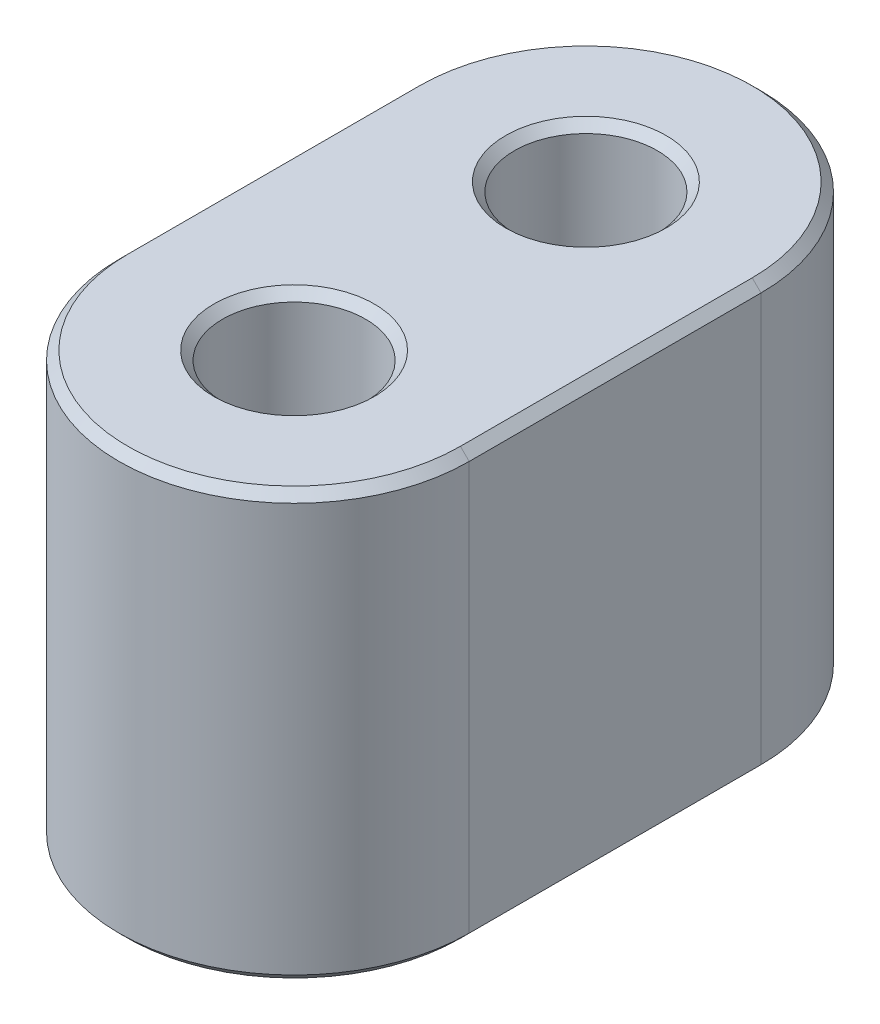
ISO-10303-21;
HEADER;
FILE_DESCRIPTION(('STEP AP214'),'2;1');
FILE_NAME('part.step','',(''),(''),'','','');
FILE_SCHEMA(('AUTOMOTIVE_DESIGN { 1 0 10303 214 1 1 1 1 }'));
ENDSEC;
DATA;
#1=APPLICATION_CONTEXT('core data for automotive mechanical design processes');
#2=APPLICATION_PROTOCOL_DEFINITION('international standard','automotive_design',2000,#1);
#3=PRODUCT_CONTEXT('',#1,'mechanical');
#4=PRODUCT('Part','Part','',(#3));
#5=PRODUCT_RELATED_PRODUCT_CATEGORY('part','',(#4));
#6=PRODUCT_DEFINITION_FORMATION('','',#4);
#7=PRODUCT_DEFINITION_CONTEXT('part definition',#1,'design');
#8=PRODUCT_DEFINITION('design','',#6,#7);
#9=PRODUCT_DEFINITION_SHAPE('','',#8);
#10=(LENGTH_UNIT() NAMED_UNIT(*) SI_UNIT(.MILLI.,.METRE.));
#11=(NAMED_UNIT(*) PLANE_ANGLE_UNIT() SI_UNIT($,.RADIAN.));
#12=(NAMED_UNIT(*) SI_UNIT($,.STERADIAN.) SOLID_ANGLE_UNIT());
#13=UNCERTAINTY_MEASURE_WITH_UNIT(LENGTH_MEASURE(1.E-05),#10,'distance_accuracy_value','');
#14=(GEOMETRIC_REPRESENTATION_CONTEXT(3) GLOBAL_UNCERTAINTY_ASSIGNED_CONTEXT((#13)) GLOBAL_UNIT_ASSIGNED_CONTEXT((#10,
#11,#12)) REPRESENTATION_CONTEXT('',''));
#15=CARTESIAN_POINT('',(0.,0.,0.));
#16=DIRECTION('',(0.,0.,1.));
#17=DIRECTION('',(1.,0.,0.));
#18=AXIS2_PLACEMENT_3D('',#15,#16,#17);
#19=CARTESIAN_POINT('',(0.,14.6,0.));
#20=DIRECTION('',(0.,1.,0.));
#21=DIRECTION('',(0.,0.,1.));
#22=AXIS2_PLACEMENT_3D('',#19,#20,#21);
#23=PLANE('',#22);
#24=CARTESIAN_POINT('',(0.,14.6,-10.));
#25=DIRECTION('',(0.,1.,0.));
#26=DIRECTION('',(0.,0.,1.));
#27=AXIS2_PLACEMENT_3D('',#24,#25,#26);
#28=CIRCLE('',#27,2.75);
#29=CARTESIAN_POINT('',(0.,14.6,-7.25));
#30=VERTEX_POINT('',#29);
#31=EDGE_CURVE('E140',#30,#30,#28,.F.);
#32=ORIENTED_EDGE('',*,*,#31,.T.);
#33=EDGE_LOOP('',(#32));
#34=FACE_BOUND('',#33,.T.);
#35=CARTESIAN_POINT('',(0.,14.6,-10.));
#36=DIRECTION('',(0.,1.,0.));
#37=DIRECTION('',(0.,0.,1.));
#38=AXIS2_PLACEMENT_3D('',#35,#36,#37);
#39=CIRCLE('',#38,5.7);
#40=CARTESIAN_POINT('',(5.7,14.6,-10.));
#41=VERTEX_POINT('',#40);
#42=CARTESIAN_POINT('',(-5.7,14.6,-10.));
#43=VERTEX_POINT('',#42);
#44=EDGE_CURVE('E137',#41,#43,#39,.T.);
#45=ORIENTED_EDGE('',*,*,#44,.T.);
#46=DIRECTION('',(0.,0.,1.));
#47=VECTOR('',#46,1.);
#48=CARTESIAN_POINT('',(-5.7,14.6,0.));
#49=LINE('',#48,#47);
#50=CARTESIAN_POINT('',(-5.7,14.6,0.));
#51=VERTEX_POINT('',#50);
#52=EDGE_CURVE('E117',#43,#51,#49,.T.);
#53=ORIENTED_EDGE('',*,*,#52,.T.);
#54=CARTESIAN_POINT('',(0.,14.6,0.));
#55=DIRECTION('',(0.,1.,0.));
#56=DIRECTION('',(0.,0.,1.));
#57=AXIS2_PLACEMENT_3D('',#54,#55,#56);
#58=CIRCLE('',#57,5.7);
#59=CARTESIAN_POINT('',(5.7,14.6,0.));
#60=VERTEX_POINT('',#59);
#61=EDGE_CURVE('E125',#51,#60,#58,.T.);
#62=ORIENTED_EDGE('',*,*,#61,.T.);
#63=DIRECTION('',(0.,0.,-1.));
#64=VECTOR('',#63,1.);
#65=CARTESIAN_POINT('',(5.7,14.6,-10.));
#66=LINE('',#65,#64);
#67=EDGE_CURVE('E132',#60,#41,#66,.T.);
#68=ORIENTED_EDGE('',*,*,#67,.T.);
#69=EDGE_LOOP('',(#45,#53,#62,#68));
#70=FACE_BOUND('',#69,.T.);
#71=CARTESIAN_POINT('',(0.,14.6,0.));
#72=DIRECTION('',(0.,1.,0.));
#73=DIRECTION('',(0.,0.,1.));
#74=AXIS2_PLACEMENT_3D('',#71,#72,#73);
#75=CIRCLE('',#74,2.75);
#76=CARTESIAN_POINT('',(0.,14.6,2.75));
#77=VERTEX_POINT('',#76);
#78=EDGE_CURVE('E133',#77,#77,#75,.F.);
#79=ORIENTED_EDGE('',*,*,#78,.T.);
#80=EDGE_LOOP('',(#79));
#81=FACE_BOUND('',#80,.T.);
#82=ADVANCED_FACE('F43',(#34,#70,#81),#23,.T.);
#83=CARTESIAN_POINT('',(0.,0.,0.));
#84=DIRECTION('',(0.,1.,0.));
#85=DIRECTION('',(0.,0.,1.));
#86=AXIS2_PLACEMENT_3D('',#83,#84,#85);
#87=PLANE('',#86);
#88=CARTESIAN_POINT('',(0.,0.,-10.));
#89=DIRECTION('',(0.,1.,0.));
#90=DIRECTION('',(0.,0.,1.));
#91=AXIS2_PLACEMENT_3D('',#88,#89,#90);
#92=CIRCLE('',#91,2.75);
#93=CARTESIAN_POINT('',(0.,0.,-7.25));
#94=VERTEX_POINT('',#93);
#95=EDGE_CURVE('E11',#94,#94,#92,.T.);
#96=ORIENTED_EDGE('',*,*,#95,.T.);
#97=EDGE_LOOP('',(#96));
#98=FACE_BOUND('',#97,.T.);
#99=CARTESIAN_POINT('',(0.,0.,0.));
#100=DIRECTION('',(0.,1.,0.));
#101=DIRECTION('',(0.,0.,1.));
#102=AXIS2_PLACEMENT_3D('',#99,#100,#101);
#103=CIRCLE('',#102,2.75);
#104=CARTESIAN_POINT('',(0.,0.,2.75));
#105=VERTEX_POINT('',#104);
#106=EDGE_CURVE('E54',#105,#105,#103,.T.);
#107=ORIENTED_EDGE('',*,*,#106,.T.);
#108=EDGE_LOOP('',(#107));
#109=FACE_BOUND('',#108,.T.);
#110=CARTESIAN_POINT('',(0.,0.,-10.));
#111=DIRECTION('',(0.,1.,0.));
#112=DIRECTION('',(0.,0.,1.));
#113=AXIS2_PLACEMENT_3D('',#110,#111,#112);
#114=CIRCLE('',#113,5.69999999999999);
#115=CARTESIAN_POINT('',(-5.69999999999999,0.,-10.));
#116=VERTEX_POINT('',#115);
#117=CARTESIAN_POINT('',(5.69999999999999,0.,-10.));
#118=VERTEX_POINT('',#117);
#119=EDGE_CURVE('E62',#116,#118,#114,.F.);
#120=ORIENTED_EDGE('',*,*,#119,.T.);
#121=DIRECTION('',(0.,0.,1.));
#122=VECTOR('',#121,1.);
#123=CARTESIAN_POINT('',(5.69999999999999,0.,0.));
#124=LINE('',#123,#122);
#125=CARTESIAN_POINT('',(5.69999999999999,0.,0.));
#126=VERTEX_POINT('',#125);
#127=EDGE_CURVE('E189',#118,#126,#124,.T.);
#128=ORIENTED_EDGE('',*,*,#127,.T.);
#129=CARTESIAN_POINT('',(0.,0.,0.));
#130=DIRECTION('',(0.,1.,0.));
#131=DIRECTION('',(0.,0.,1.));
#132=AXIS2_PLACEMENT_3D('',#129,#130,#131);
#133=CIRCLE('',#132,5.69999999999999);
#134=CARTESIAN_POINT('',(-5.69999999999999,0.,0.));
#135=VERTEX_POINT('',#134);
#136=EDGE_CURVE('E182',#126,#135,#133,.F.);
#137=ORIENTED_EDGE('',*,*,#136,.T.);
#138=DIRECTION('',(0.,0.,-1.));
#139=VECTOR('',#138,1.);
#140=CARTESIAN_POINT('',(-5.69999999999999,0.,0.));
#141=LINE('',#140,#139);
#142=EDGE_CURVE('E67',#135,#116,#141,.T.);
#143=ORIENTED_EDGE('',*,*,#142,.T.);
#144=EDGE_LOOP('',(#120,#128,#137,#143));
#145=FACE_BOUND('',#144,.T.);
#146=ADVANCED_FACE('F222',(#98,#109,#145),#87,.F.);
#147=CARTESIAN_POINT('',(0.,14.6,0.));
#148=DIRECTION('',(0.,-1.,0.));
#149=DIRECTION('',(0.,0.,-1.));
#150=AXIS2_PLACEMENT_3D('',#147,#148,#149);
#151=CYLINDRICAL_SURFACE('',#150,6.);
#152=DIRECTION('',(0.,-1.,0.));
#153=VECTOR('',#152,1.);
#154=CARTESIAN_POINT('',(6.,14.6,0.));
#155=LINE('',#154,#153);
#156=CARTESIAN_POINT('',(6.,14.3,0.));
#157=VERTEX_POINT('',#156);
#158=CARTESIAN_POINT('',(6.,0.300000000000007,0.));
#159=VERTEX_POINT('',#158);
#160=EDGE_CURVE('E462',#157,#159,#155,.T.);
#161=ORIENTED_EDGE('',*,*,#160,.F.);
#162=CARTESIAN_POINT('',(0.,14.3,0.));
#163=DIRECTION('',(0.,1.,0.));
#164=DIRECTION('',(0.,0.,1.));
#165=AXIS2_PLACEMENT_3D('',#162,#163,#164);
#166=CIRCLE('',#165,6.);
#167=CARTESIAN_POINT('',(-6.,14.3,0.));
#168=VERTEX_POINT('',#167);
#169=EDGE_CURVE('E171',#157,#168,#166,.F.);
#170=ORIENTED_EDGE('',*,*,#169,.T.);
#171=DIRECTION('',(0.,-1.,0.));
#172=VECTOR('',#171,1.);
#173=CARTESIAN_POINT('',(-6.,14.6,0.));
#174=LINE('',#173,#172);
#175=CARTESIAN_POINT('',(-6.,0.300000000000007,0.));
#176=VERTEX_POINT('',#175);
#177=EDGE_CURVE('E200',#168,#176,#174,.T.);
#178=ORIENTED_EDGE('',*,*,#177,.T.);
#179=CARTESIAN_POINT('',(0.,0.300000000000007,0.));
#180=DIRECTION('',(0.,1.,0.));
#181=DIRECTION('',(0.,0.,1.));
#182=AXIS2_PLACEMENT_3D('',#179,#180,#181);
#183=CIRCLE('',#182,6.);
#184=EDGE_CURVE('E168',#176,#159,#183,.T.);
#185=ORIENTED_EDGE('',*,*,#184,.T.);
#186=EDGE_LOOP('',(#161,#170,#178,#185));
#187=FACE_BOUND('',#186,.T.);
#188=ADVANCED_FACE('F224',(#187),#151,.T.);
#189=CARTESIAN_POINT('',(6.,14.6,0.));
#190=DIRECTION('',(-1.,0.,0.));
#191=DIRECTION('',(0.,0.,1.));
#192=AXIS2_PLACEMENT_3D('',#189,#190,#191);
#193=PLANE('',#192);
#194=DIRECTION('',(0.,-1.,0.));
#195=VECTOR('',#194,1.);
#196=CARTESIAN_POINT('',(6.,14.6,-10.));
#197=LINE('',#196,#195);
#198=CARTESIAN_POINT('',(6.,14.3,-10.));
#199=VERTEX_POINT('',#198);
#200=CARTESIAN_POINT('',(6.,0.300000000000007,-10.));
#201=VERTEX_POINT('',#200);
#202=EDGE_CURVE('E468',#199,#201,#197,.T.);
#203=ORIENTED_EDGE('',*,*,#202,.F.);
#204=DIRECTION('',(0.,0.,1.));
#205=VECTOR('',#204,1.);
#206=CARTESIAN_POINT('',(6.,14.3,0.));
#207=LINE('',#206,#205);
#208=EDGE_CURVE('E165',#199,#157,#207,.T.);
#209=ORIENTED_EDGE('',*,*,#208,.T.);
#210=ORIENTED_EDGE('',*,*,#160,.T.);
#211=DIRECTION('',(0.,0.,-1.));
#212=VECTOR('',#211,1.);
#213=CARTESIAN_POINT('',(6.,0.300000000000007,0.));
#214=LINE('',#213,#212);
#215=EDGE_CURVE('E162',#159,#201,#214,.T.);
#216=ORIENTED_EDGE('',*,*,#215,.T.);
#217=EDGE_LOOP('',(#203,#209,#210,#216));
#218=FACE_BOUND('',#217,.T.);
#219=ADVANCED_FACE('F231',(#218),#193,.F.);
#220=CARTESIAN_POINT('',(0.,14.6,-10.));
#221=DIRECTION('',(0.,-1.,0.));
#222=DIRECTION('',(0.,0.,-1.));
#223=AXIS2_PLACEMENT_3D('',#220,#221,#222);
#224=CYLINDRICAL_SURFACE('',#223,6.);
#225=DIRECTION('',(0.,-1.,0.));
#226=VECTOR('',#225,1.);
#227=CARTESIAN_POINT('',(-6.,14.6,-10.));
#228=LINE('',#227,#226);
#229=CARTESIAN_POINT('',(-6.,14.3,-10.));
#230=VERTEX_POINT('',#229);
#231=CARTESIAN_POINT('',(-6.,0.300000000000007,-10.));
#232=VERTEX_POINT('',#231);
#233=EDGE_CURVE('E483',#230,#232,#228,.T.);
#234=ORIENTED_EDGE('',*,*,#233,.F.);
#235=CARTESIAN_POINT('',(0.,14.3,-10.));
#236=DIRECTION('',(0.,1.,0.));
#237=DIRECTION('',(0.,0.,1.));
#238=AXIS2_PLACEMENT_3D('',#235,#236,#237);
#239=CIRCLE('',#238,6.);
#240=EDGE_CURVE('E159',#230,#199,#239,.F.);
#241=ORIENTED_EDGE('',*,*,#240,.T.);
#242=ORIENTED_EDGE('',*,*,#202,.T.);
#243=CARTESIAN_POINT('',(0.,0.300000000000007,-10.));
#244=DIRECTION('',(0.,1.,0.));
#245=DIRECTION('',(0.,0.,1.));
#246=AXIS2_PLACEMENT_3D('',#243,#244,#245);
#247=CIRCLE('',#246,6.);
#248=EDGE_CURVE('E156',#201,#232,#247,.T.);
#249=ORIENTED_EDGE('',*,*,#248,.T.);
#250=EDGE_LOOP('',(#234,#241,#242,#249));
#251=FACE_BOUND('',#250,.T.);
#252=ADVANCED_FACE('F244',(#251),#224,.T.);
#253=CARTESIAN_POINT('',(-6.,14.6,0.));
#254=DIRECTION('',(1.,0.,0.));
#255=DIRECTION('',(0.,0.,-1.));
#256=AXIS2_PLACEMENT_3D('',#253,#254,#255);
#257=PLANE('',#256);
#258=ORIENTED_EDGE('',*,*,#177,.F.);
#259=DIRECTION('',(0.,0.,-1.));
#260=VECTOR('',#259,1.);
#261=CARTESIAN_POINT('',(-6.,14.3,-10.));
#262=LINE('',#261,#260);
#263=EDGE_CURVE('E119',#168,#230,#262,.T.);
#264=ORIENTED_EDGE('',*,*,#263,.T.);
#265=ORIENTED_EDGE('',*,*,#233,.T.);
#266=DIRECTION('',(0.,0.,1.));
#267=VECTOR('',#266,1.);
#268=CARTESIAN_POINT('',(-6.,0.300000000000007,0.));
#269=LINE('',#268,#267);
#270=EDGE_CURVE('E147',#232,#176,#269,.T.);
#271=ORIENTED_EDGE('',*,*,#270,.T.);
#272=EDGE_LOOP('',(#258,#264,#265,#271));
#273=FACE_BOUND('',#272,.T.);
#274=ADVANCED_FACE('F240',(#273),#257,.F.);
#275=CARTESIAN_POINT('',(0.,14.6,0.));
#276=DIRECTION('',(0.,-1.,0.));
#277=DIRECTION('',(0.,0.,-1.));
#278=AXIS2_PLACEMENT_3D('',#275,#276,#277);
#279=CYLINDRICAL_SURFACE('',#278,2.45);
#280=CARTESIAN_POINT('',(0.,14.3,0.));
#281=DIRECTION('',(0.,1.,0.));
#282=DIRECTION('',(0.,0.,1.));
#283=AXIS2_PLACEMENT_3D('',#280,#281,#282);
#284=CIRCLE('',#283,2.45);
#285=CARTESIAN_POINT('',(0.,14.3,2.45));
#286=VERTEX_POINT('',#285);
#287=EDGE_CURVE('E178',#286,#286,#284,.T.);
#288=ORIENTED_EDGE('',*,*,#287,.T.);
#289=EDGE_LOOP('',(#288));
#290=FACE_BOUND('',#289,.T.);
#291=CARTESIAN_POINT('',(0.,0.3,0.));
#292=DIRECTION('',(0.,1.,0.));
#293=DIRECTION('',(0.,0.,1.));
#294=AXIS2_PLACEMENT_3D('',#291,#292,#293);
#295=CIRCLE('',#294,2.45);
#296=CARTESIAN_POINT('',(0.,0.3,2.45));
#297=VERTEX_POINT('',#296);
#298=EDGE_CURVE('E174',#297,#297,#295,.F.);
#299=ORIENTED_EDGE('',*,*,#298,.T.);
#300=EDGE_LOOP('',(#299));
#301=FACE_BOUND('',#300,.T.);
#302=ADVANCED_FACE('F243',(#290,#301),#279,.F.);
#303=CARTESIAN_POINT('',(0.,14.6,-10.));
#304=DIRECTION('',(0.,-1.,0.));
#305=DIRECTION('',(0.,0.,-1.));
#306=AXIS2_PLACEMENT_3D('',#303,#304,#305);
#307=CYLINDRICAL_SURFACE('',#306,2.45);
#308=CARTESIAN_POINT('',(0.,14.3,-10.));
#309=DIRECTION('',(0.,1.,0.));
#310=DIRECTION('',(0.,0.,1.));
#311=AXIS2_PLACEMENT_3D('',#308,#309,#310);
#312=CIRCLE('',#311,2.45);
#313=CARTESIAN_POINT('',(0.,14.3,-7.55));
#314=VERTEX_POINT('',#313);
#315=EDGE_CURVE('E458',#314,#314,#312,.T.);
#316=ORIENTED_EDGE('',*,*,#315,.T.);
#317=EDGE_LOOP('',(#316));
#318=FACE_BOUND('',#317,.T.);
#319=CARTESIAN_POINT('',(0.,0.300000000000003,-10.));
#320=DIRECTION('',(0.,1.,0.));
#321=DIRECTION('',(0.,0.,1.));
#322=AXIS2_PLACEMENT_3D('',#319,#320,#321);
#323=CIRCLE('',#322,2.45);
#324=CARTESIAN_POINT('',(0.,0.300000000000003,-7.55));
#325=VERTEX_POINT('',#324);
#326=EDGE_CURVE('E461',#325,#325,#323,.F.);
#327=ORIENTED_EDGE('',*,*,#326,.T.);
#328=EDGE_LOOP('',(#327));
#329=FACE_BOUND('',#328,.T.);
#330=ADVANCED_FACE('F260',(#318,#329),#307,.F.);
#331=CARTESIAN_POINT('',(0.,14.3,-10.));
#332=DIRECTION('',(0.,1.,0.));
#333=DIRECTION('',(0.,0.,1.));
#334=AXIS2_PLACEMENT_3D('',#331,#332,#333);
#335=CONICAL_SURFACE('',#334,2.45,0.785398163397454);
#336=ORIENTED_EDGE('',*,*,#31,.F.);
#337=EDGE_LOOP('',(#336));
#338=FACE_BOUND('',#337,.T.);
#339=ORIENTED_EDGE('',*,*,#315,.F.);
#340=EDGE_LOOP('',(#339));
#341=FACE_BOUND('',#340,.T.);
#342=ADVANCED_FACE('F253',(#338,#341),#335,.F.);
#343=CARTESIAN_POINT('',(5.7,14.6,0.));
#344=DIRECTION('',(0.707106781186547,0.707106781186549,0.));
#345=DIRECTION('',(0.,0.,1.));
#346=AXIS2_PLACEMENT_3D('',#343,#344,#345);
#347=PLANE('',#346);
#348=DIRECTION('',(-0.707106781186549,0.707106781186547,0.));
#349=VECTOR('',#348,1.);
#350=CARTESIAN_POINT('',(6.,14.3,0.));
#351=LINE('',#350,#349);
#352=EDGE_CURVE('E128',#157,#60,#351,.T.);
#353=ORIENTED_EDGE('',*,*,#352,.F.);
#354=ORIENTED_EDGE('',*,*,#208,.F.);
#355=DIRECTION('',(0.707106781186549,-0.707106781186547,0.));
#356=VECTOR('',#355,1.);
#357=CARTESIAN_POINT('',(5.7,14.6,-10.));
#358=LINE('',#357,#356);
#359=EDGE_CURVE('E197',#41,#199,#358,.T.);
#360=ORIENTED_EDGE('',*,*,#359,.F.);
#361=ORIENTED_EDGE('',*,*,#67,.F.);
#362=EDGE_LOOP('',(#353,#354,#360,#361));
#363=FACE_BOUND('',#362,.T.);
#364=ADVANCED_FACE('F259',(#363),#347,.T.);
#365=CARTESIAN_POINT('',(0.,14.6,-10.));
#366=DIRECTION('',(0.,-1.,0.));
#367=DIRECTION('',(0.,0.,-1.));
#368=AXIS2_PLACEMENT_3D('',#365,#366,#367);
#369=CONICAL_SURFACE('',#368,5.7,0.78539816339745);
#370=ORIENTED_EDGE('',*,*,#359,.T.);
#371=ORIENTED_EDGE('',*,*,#240,.F.);
#372=DIRECTION('',(-0.707106781186549,-0.707106781186547,0.));
#373=VECTOR('',#372,1.);
#374=CARTESIAN_POINT('',(-5.7,14.6,-10.));
#375=LINE('',#374,#373);
#376=EDGE_CURVE('E122',#43,#230,#375,.T.);
#377=ORIENTED_EDGE('',*,*,#376,.F.);
#378=ORIENTED_EDGE('',*,*,#44,.F.);
#379=EDGE_LOOP('',(#370,#371,#377,#378));
#380=FACE_BOUND('',#379,.T.);
#381=ADVANCED_FACE('F275',(#380),#369,.T.);
#382=CARTESIAN_POINT('',(0.,14.6,0.));
#383=DIRECTION('',(0.,-1.,0.));
#384=DIRECTION('',(0.,0.,-1.));
#385=AXIS2_PLACEMENT_3D('',#382,#383,#384);
#386=CONICAL_SURFACE('',#385,5.7,0.78539816339745);
#387=ORIENTED_EDGE('',*,*,#352,.T.);
#388=ORIENTED_EDGE('',*,*,#61,.F.);
#389=DIRECTION('',(0.707106781186549,0.707106781186547,0.));
#390=VECTOR('',#389,1.);
#391=CARTESIAN_POINT('',(-6.,14.3,0.));
#392=LINE('',#391,#390);
#393=EDGE_CURVE('E113',#168,#51,#392,.T.);
#394=ORIENTED_EDGE('',*,*,#393,.F.);
#395=ORIENTED_EDGE('',*,*,#169,.F.);
#396=EDGE_LOOP('',(#387,#388,#394,#395));
#397=FACE_BOUND('',#396,.T.);
#398=ADVANCED_FACE('F126',(#397),#386,.T.);
#399=CARTESIAN_POINT('',(-5.7,14.6,0.));
#400=DIRECTION('',(-0.707106781186547,0.707106781186549,0.));
#401=DIRECTION('',(0.,0.,-1.));
#402=AXIS2_PLACEMENT_3D('',#399,#400,#401);
#403=PLANE('',#402);
#404=ORIENTED_EDGE('',*,*,#376,.T.);
#405=ORIENTED_EDGE('',*,*,#263,.F.);
#406=ORIENTED_EDGE('',*,*,#393,.T.);
#407=ORIENTED_EDGE('',*,*,#52,.F.);
#408=EDGE_LOOP('',(#404,#405,#406,#407));
#409=FACE_BOUND('',#408,.T.);
#410=ADVANCED_FACE('F115',(#409),#403,.T.);
#411=CARTESIAN_POINT('',(0.,14.3,0.));
#412=DIRECTION('',(0.,1.,0.));
#413=DIRECTION('',(0.,0.,1.));
#414=AXIS2_PLACEMENT_3D('',#411,#412,#413);
#415=CONICAL_SURFACE('',#414,2.45,0.785398163397454);
#416=ORIENTED_EDGE('',*,*,#78,.F.);
#417=EDGE_LOOP('',(#416));
#418=FACE_BOUND('',#417,.T.);
#419=ORIENTED_EDGE('',*,*,#287,.F.);
#420=EDGE_LOOP('',(#419));
#421=FACE_BOUND('',#420,.T.);
#422=ADVANCED_FACE('F269',(#418,#421),#415,.F.);
#423=CARTESIAN_POINT('',(0.,0.,-10.));
#424=DIRECTION('',(0.,-1.,0.));
#425=DIRECTION('',(0.,0.,-1.));
#426=AXIS2_PLACEMENT_3D('',#423,#424,#425);
#427=CONICAL_SURFACE('',#426,2.75,0.785398163397445);
#428=ORIENTED_EDGE('',*,*,#326,.F.);
#429=EDGE_LOOP('',(#428));
#430=FACE_BOUND('',#429,.T.);
#431=ORIENTED_EDGE('',*,*,#95,.F.);
#432=EDGE_LOOP('',(#431));
#433=FACE_BOUND('',#432,.T.);
#434=ADVANCED_FACE('F291',(#430,#433),#427,.F.);
#435=CARTESIAN_POINT('',(0.,0.,0.));
#436=DIRECTION('',(0.,-1.,0.));
#437=DIRECTION('',(0.,0.,-1.));
#438=AXIS2_PLACEMENT_3D('',#435,#436,#437);
#439=CONICAL_SURFACE('',#438,2.75,0.785398163397445);
#440=ORIENTED_EDGE('',*,*,#298,.F.);
#441=EDGE_LOOP('',(#440));
#442=FACE_BOUND('',#441,.T.);
#443=ORIENTED_EDGE('',*,*,#106,.F.);
#444=EDGE_LOOP('',(#443));
#445=FACE_BOUND('',#444,.T.);
#446=ADVANCED_FACE('F298',(#442,#445),#439,.F.);
#447=CARTESIAN_POINT('',(-6.,0.300000000000007,0.));
#448=DIRECTION('',(0.707106781186547,0.707106781186547,0.));
#449=DIRECTION('',(0.,0.,1.));
#450=AXIS2_PLACEMENT_3D('',#447,#448,#449);
#451=PLANE('',#450);
#452=DIRECTION('',(-0.707106781186547,0.707106781186547,0.));
#453=VECTOR('',#452,1.);
#454=CARTESIAN_POINT('',(-5.69999999999999,0.,-10.));
#455=LINE('',#454,#453);
#456=EDGE_CURVE('E204',#116,#232,#455,.T.);
#457=ORIENTED_EDGE('',*,*,#456,.F.);
#458=ORIENTED_EDGE('',*,*,#142,.F.);
#459=DIRECTION('',(0.707106781186547,-0.707106781186547,0.));
#460=VECTOR('',#459,1.);
#461=CARTESIAN_POINT('',(-6.,0.300000000000007,0.));
#462=LINE('',#461,#460);
#463=EDGE_CURVE('E48',#176,#135,#462,.T.);
#464=ORIENTED_EDGE('',*,*,#463,.F.);
#465=ORIENTED_EDGE('',*,*,#270,.F.);
#466=EDGE_LOOP('',(#457,#458,#464,#465));
#467=FACE_BOUND('',#466,.T.);
#468=ADVANCED_FACE('F46',(#467),#451,.F.);
#469=CARTESIAN_POINT('',(0.,0.300000000000007,0.));
#470=DIRECTION('',(0.,1.,0.));
#471=DIRECTION('',(0.,0.,1.));
#472=AXIS2_PLACEMENT_3D('',#469,#470,#471);
#473=CONICAL_SURFACE('',#472,6.,0.785398163397448);
#474=ORIENTED_EDGE('',*,*,#463,.T.);
#475=ORIENTED_EDGE('',*,*,#136,.F.);
#476=DIRECTION('',(-0.707106781186547,-0.707106781186547,0.));
#477=VECTOR('',#476,1.);
#478=CARTESIAN_POINT('',(6.,0.300000000000007,0.));
#479=LINE('',#478,#477);
#480=EDGE_CURVE('E203',#159,#126,#479,.T.);
#481=ORIENTED_EDGE('',*,*,#480,.F.);
#482=ORIENTED_EDGE('',*,*,#184,.F.);
#483=EDGE_LOOP('',(#474,#475,#481,#482));
#484=FACE_BOUND('',#483,.T.);
#485=ADVANCED_FACE('F213',(#484),#473,.T.);
#486=CARTESIAN_POINT('',(0.,0.300000000000007,-10.));
#487=DIRECTION('',(0.,1.,0.));
#488=DIRECTION('',(0.,0.,1.));
#489=AXIS2_PLACEMENT_3D('',#486,#487,#488);
#490=CONICAL_SURFACE('',#489,6.,0.785398163397448);
#491=ORIENTED_EDGE('',*,*,#456,.T.);
#492=ORIENTED_EDGE('',*,*,#248,.F.);
#493=DIRECTION('',(0.707106781186547,0.707106781186547,0.));
#494=VECTOR('',#493,1.);
#495=CARTESIAN_POINT('',(5.69999999999999,0.,-10.));
#496=LINE('',#495,#494);
#497=EDGE_CURVE('E201',#118,#201,#496,.T.);
#498=ORIENTED_EDGE('',*,*,#497,.F.);
#499=ORIENTED_EDGE('',*,*,#119,.F.);
#500=EDGE_LOOP('',(#491,#492,#498,#499));
#501=FACE_BOUND('',#500,.T.);
#502=ADVANCED_FACE('F218',(#501),#490,.T.);
#503=CARTESIAN_POINT('',(6.,0.300000000000007,0.));
#504=DIRECTION('',(-0.707106781186547,0.707106781186547,0.));
#505=DIRECTION('',(0.,0.,-1.));
#506=AXIS2_PLACEMENT_3D('',#503,#504,#505);
#507=PLANE('',#506);
#508=ORIENTED_EDGE('',*,*,#480,.T.);
#509=ORIENTED_EDGE('',*,*,#127,.F.);
#510=ORIENTED_EDGE('',*,*,#497,.T.);
#511=ORIENTED_EDGE('',*,*,#215,.F.);
#512=EDGE_LOOP('',(#508,#509,#510,#511));
#513=FACE_BOUND('',#512,.T.);
#514=ADVANCED_FACE('F221',(#513),#507,.F.);
#515=CLOSED_SHELL('',(#82,#146,#188,#219,#252,#274,#302,#330,#342,#364,#381,#398,#410,#422,#434,
#446,#468,#485,#502,#514));
#516=MANIFOLD_SOLID_BREP('B2',#515);
#517=ADVANCED_BREP_SHAPE_REPRESENTATION('',(#18,#516),#14);
#518=SHAPE_DEFINITION_REPRESENTATION(#9,#517);
ENDSEC;
END-ISO-10303-21;
